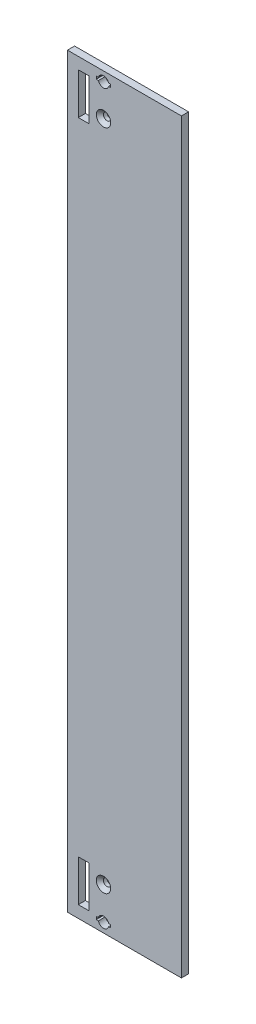
ISO-10303-21;
HEADER;
FILE_DESCRIPTION(('STEP AP214'),'2;1');
FILE_NAME('part.step','',(''),(''),'','','');
FILE_SCHEMA(('AUTOMOTIVE_DESIGN { 1 0 10303 214 1 1 1 1 }'));
ENDSEC;
DATA;
#1=APPLICATION_CONTEXT('core data for automotive mechanical design processes');
#2=APPLICATION_PROTOCOL_DEFINITION('international standard','automotive_design',2000,#1);
#3=PRODUCT_CONTEXT('',#1,'mechanical');
#4=PRODUCT('Part','Part','',(#3));
#5=PRODUCT_RELATED_PRODUCT_CATEGORY('part','',(#4));
#6=PRODUCT_DEFINITION_FORMATION('','',#4);
#7=PRODUCT_DEFINITION_CONTEXT('part definition',#1,'design');
#8=PRODUCT_DEFINITION('design','',#6,#7);
#9=PRODUCT_DEFINITION_SHAPE('','',#8);
#10=(LENGTH_UNIT() NAMED_UNIT(*) SI_UNIT(.MILLI.,.METRE.));
#11=(NAMED_UNIT(*) PLANE_ANGLE_UNIT() SI_UNIT($,.RADIAN.));
#12=(NAMED_UNIT(*) SI_UNIT($,.STERADIAN.) SOLID_ANGLE_UNIT());
#13=UNCERTAINTY_MEASURE_WITH_UNIT(LENGTH_MEASURE(1.E-05),#10,'distance_accuracy_value','');
#14=(GEOMETRIC_REPRESENTATION_CONTEXT(3) GLOBAL_UNCERTAINTY_ASSIGNED_CONTEXT((#13)) GLOBAL_UNIT_ASSIGNED_CONTEXT((#10,
#11,#12)) REPRESENTATION_CONTEXT('',''));
#15=CARTESIAN_POINT('',(0.,0.,0.));
#16=DIRECTION('',(0.,0.,1.));
#17=DIRECTION('',(1.,0.,0.));
#18=AXIS2_PLACEMENT_3D('',#15,#16,#17);
#19=CARTESIAN_POINT('',(0.,0.,2.5));
#20=DIRECTION('',(0.,0.,-1.));
#21=DIRECTION('',(-1.,0.,0.));
#22=AXIS2_PLACEMENT_3D('',#19,#20,#21);
#23=PLANE('',#22);
#24=CARTESIAN_POINT('',(12.65,14.75,2.5));
#25=DIRECTION('',(0.,0.,-1.));
#26=DIRECTION('',(-1.,0.,0.));
#27=AXIS2_PLACEMENT_3D('',#24,#25,#26);
#28=CIRCLE('',#27,2.53);
#29=CARTESIAN_POINT('',(10.12,14.75,2.5));
#30=VERTEX_POINT('',#29);
#31=EDGE_CURVE('E11',#30,#30,#28,.T.);
#32=ORIENTED_EDGE('',*,*,#31,.T.);
#33=EDGE_LOOP('',(#32));
#34=FACE_BOUND('',#33,.T.);
#35=CARTESIAN_POINT('',(12.65,247.5,2.5));
#36=DIRECTION('',(0.,0.,-1.));
#37=DIRECTION('',(-1.,0.,0.));
#38=AXIS2_PLACEMENT_3D('',#35,#36,#37);
#39=CIRCLE('',#38,2.53);
#40=CARTESIAN_POINT('',(10.12,247.5,2.5));
#41=VERTEX_POINT('',#40);
#42=EDGE_CURVE('E442',#41,#41,#39,.T.);
#43=ORIENTED_EDGE('',*,*,#42,.T.);
#44=EDGE_LOOP('',(#43));
#45=FACE_BOUND('',#44,.T.);
#46=CARTESIAN_POINT('',(12.65,3.3,2.5));
#47=DIRECTION('',(0.,0.,1.));
#48=DIRECTION('',(-1.,0.,0.));
#49=AXIS2_PLACEMENT_3D('',#46,#47,#48);
#50=CIRCLE('',#49,1.86);
#51=CARTESIAN_POINT('',(14.4415356541247,3.8,2.5));
#52=VERTEX_POINT('',#51);
#53=CARTESIAN_POINT('',(10.8584643458753,3.8,2.5));
#54=VERTEX_POINT('',#53);
#55=EDGE_CURVE('E283',#52,#54,#50,.T.);
#56=ORIENTED_EDGE('',*,*,#55,.F.);
#57=DIRECTION('',(-1.,0.,0.));
#58=VECTOR('',#57,1.);
#59=CARTESIAN_POINT('',(15.1915356541247,3.8,2.5));
#60=LINE('',#59,#58);
#61=CARTESIAN_POINT('',(15.1915356541247,3.8,2.5));
#62=VERTEX_POINT('',#61);
#63=EDGE_CURVE('E299',#62,#52,#60,.T.);
#64=ORIENTED_EDGE('',*,*,#63,.F.);
#65=DIRECTION('',(0.,1.,0.));
#66=VECTOR('',#65,1.);
#67=CARTESIAN_POINT('',(15.1915356541247,2.8,2.5));
#68=LINE('',#67,#66);
#69=CARTESIAN_POINT('',(15.1915356541247,2.8,2.5));
#70=VERTEX_POINT('',#69);
#71=EDGE_CURVE('E296',#70,#62,#68,.T.);
#72=ORIENTED_EDGE('',*,*,#71,.F.);
#73=DIRECTION('',(1.,0.,0.));
#74=VECTOR('',#73,1.);
#75=CARTESIAN_POINT('',(14.4415356541247,2.8,2.5));
#76=LINE('',#75,#74);
#77=CARTESIAN_POINT('',(14.4415356541247,2.8,2.5));
#78=VERTEX_POINT('',#77);
#79=EDGE_CURVE('E294',#78,#70,#76,.T.);
#80=ORIENTED_EDGE('',*,*,#79,.F.);
#81=CARTESIAN_POINT('',(12.65,3.3,2.5));
#82=DIRECTION('',(0.,0.,1.));
#83=DIRECTION('',(1.,0.,0.));
#84=AXIS2_PLACEMENT_3D('',#81,#82,#83);
#85=CIRCLE('',#84,1.86);
#86=CARTESIAN_POINT('',(10.8584643458753,2.8,2.5));
#87=VERTEX_POINT('',#86);
#88=EDGE_CURVE('E292',#87,#78,#85,.T.);
#89=ORIENTED_EDGE('',*,*,#88,.F.);
#90=DIRECTION('',(1.,0.,0.));
#91=VECTOR('',#90,1.);
#92=CARTESIAN_POINT('',(10.1084643458753,2.8,2.5));
#93=LINE('',#92,#91);
#94=CARTESIAN_POINT('',(10.1084643458753,2.8,2.5));
#95=VERTEX_POINT('',#94);
#96=EDGE_CURVE('E290',#95,#87,#93,.T.);
#97=ORIENTED_EDGE('',*,*,#96,.F.);
#98=DIRECTION('',(0.,-1.,0.));
#99=VECTOR('',#98,1.);
#100=CARTESIAN_POINT('',(10.1084643458753,3.8,2.5));
#101=LINE('',#100,#99);
#102=CARTESIAN_POINT('',(10.1084643458753,3.8,2.5));
#103=VERTEX_POINT('',#102);
#104=EDGE_CURVE('E288',#103,#95,#101,.T.);
#105=ORIENTED_EDGE('',*,*,#104,.F.);
#106=DIRECTION('',(-1.,0.,0.));
#107=VECTOR('',#106,1.);
#108=CARTESIAN_POINT('',(10.8584643458753,3.8,2.5));
#109=LINE('',#108,#107);
#110=EDGE_CURVE('E285',#54,#103,#109,.T.);
#111=ORIENTED_EDGE('',*,*,#110,.F.);
#112=EDGE_LOOP('',(#56,#64,#72,#80,#89,#97,#105,#111));
#113=FACE_BOUND('',#112,.T.);
#114=DIRECTION('',(0.,-1.,0.));
#115=VECTOR('',#114,1.);
#116=CARTESIAN_POINT('',(3.8,257.95,2.5));
#117=LINE('',#116,#115);
#118=CARTESIAN_POINT('',(3.8,257.95,2.5));
#119=VERTEX_POINT('',#118);
#120=CARTESIAN_POINT('',(3.8,243.4,2.5));
#121=VERTEX_POINT('',#120);
#122=EDGE_CURVE('E379',#119,#121,#117,.T.);
#123=ORIENTED_EDGE('',*,*,#122,.F.);
#124=DIRECTION('',(-1.,0.,0.));
#125=VECTOR('',#124,1.);
#126=CARTESIAN_POINT('',(3.8,257.95,2.5));
#127=LINE('',#126,#125);
#128=CARTESIAN_POINT('',(7.6,257.95,2.5));
#129=VERTEX_POINT('',#128);
#130=EDGE_CURVE('E387',#129,#119,#127,.T.);
#131=ORIENTED_EDGE('',*,*,#130,.F.);
#132=DIRECTION('',(0.,1.,0.));
#133=VECTOR('',#132,1.);
#134=CARTESIAN_POINT('',(7.6,257.95,2.5));
#135=LINE('',#134,#133);
#136=CARTESIAN_POINT('',(7.6,243.4,2.5));
#137=VERTEX_POINT('',#136);
#138=EDGE_CURVE('E384',#137,#129,#135,.T.);
#139=ORIENTED_EDGE('',*,*,#138,.F.);
#140=DIRECTION('',(1.,0.,0.));
#141=VECTOR('',#140,1.);
#142=CARTESIAN_POINT('',(3.8,243.4,2.5));
#143=LINE('',#142,#141);
#144=EDGE_CURVE('E381',#121,#137,#143,.T.);
#145=ORIENTED_EDGE('',*,*,#144,.F.);
#146=EDGE_LOOP('',(#123,#131,#139,#145));
#147=FACE_BOUND('',#146,.T.);
#148=DIRECTION('',(0.,-1.,0.));
#149=VECTOR('',#148,1.);
#150=CARTESIAN_POINT('',(0.,0.,2.5));
#151=LINE('',#150,#149);
#152=CARTESIAN_POINT('',(0.,262.,2.5));
#153=VERTEX_POINT('',#152);
#154=CARTESIAN_POINT('',(0.,0.,2.5));
#155=VERTEX_POINT('',#154);
#156=EDGE_CURVE('E410',#153,#155,#151,.T.);
#157=ORIENTED_EDGE('',*,*,#156,.T.);
#158=DIRECTION('',(1.,0.,0.));
#159=VECTOR('',#158,1.);
#160=CARTESIAN_POINT('',(0.,0.,2.5));
#161=LINE('',#160,#159);
#162=CARTESIAN_POINT('',(40.,0.,2.5));
#163=VERTEX_POINT('',#162);
#164=EDGE_CURVE('E413',#155,#163,#161,.T.);
#165=ORIENTED_EDGE('',*,*,#164,.T.);
#166=DIRECTION('',(0.,1.,0.));
#167=VECTOR('',#166,1.);
#168=CARTESIAN_POINT('',(40.,0.,2.5));
#169=LINE('',#168,#167);
#170=CARTESIAN_POINT('',(40.,262.,2.5));
#171=VERTEX_POINT('',#170);
#172=EDGE_CURVE('E416',#163,#171,#169,.T.);
#173=ORIENTED_EDGE('',*,*,#172,.T.);
#174=DIRECTION('',(-1.,0.,0.));
#175=VECTOR('',#174,1.);
#176=CARTESIAN_POINT('',(0.,262.,2.5));
#177=LINE('',#176,#175);
#178=EDGE_CURVE('E418',#171,#153,#177,.T.);
#179=ORIENTED_EDGE('',*,*,#178,.T.);
#180=EDGE_LOOP('',(#157,#165,#173,#179));
#181=FACE_BOUND('',#180,.T.);
#182=DIRECTION('',(0.,-1.,0.));
#183=VECTOR('',#182,1.);
#184=CARTESIAN_POINT('',(3.80000000000003,18.75,2.5));
#185=LINE('',#184,#183);
#186=CARTESIAN_POINT('',(3.80000000000003,18.75,2.5));
#187=VERTEX_POINT('',#186);
#188=CARTESIAN_POINT('',(3.80000000000003,4.19999999999999,2.5));
#189=VERTEX_POINT('',#188);
#190=EDGE_CURVE('E348',#187,#189,#185,.T.);
#191=ORIENTED_EDGE('',*,*,#190,.F.);
#192=DIRECTION('',(-1.,0.,0.));
#193=VECTOR('',#192,1.);
#194=CARTESIAN_POINT('',(3.80000000000003,18.75,2.5));
#195=LINE('',#194,#193);
#196=CARTESIAN_POINT('',(7.60000000000003,18.75,2.5));
#197=VERTEX_POINT('',#196);
#198=EDGE_CURVE('E356',#197,#187,#195,.T.);
#199=ORIENTED_EDGE('',*,*,#198,.F.);
#200=DIRECTION('',(0.,1.,0.));
#201=VECTOR('',#200,1.);
#202=CARTESIAN_POINT('',(7.60000000000003,18.75,2.5));
#203=LINE('',#202,#201);
#204=CARTESIAN_POINT('',(7.60000000000003,4.19999999999999,2.5));
#205=VERTEX_POINT('',#204);
#206=EDGE_CURVE('E353',#205,#197,#203,.T.);
#207=ORIENTED_EDGE('',*,*,#206,.F.);
#208=DIRECTION('',(1.,0.,0.));
#209=VECTOR('',#208,1.);
#210=CARTESIAN_POINT('',(3.80000000000003,4.19999999999999,2.5));
#211=LINE('',#210,#209);
#212=EDGE_CURVE('E350',#189,#205,#211,.T.);
#213=ORIENTED_EDGE('',*,*,#212,.F.);
#214=EDGE_LOOP('',(#191,#199,#207,#213));
#215=FACE_BOUND('',#214,.T.);
#216=CARTESIAN_POINT('',(12.65,258.7,2.5));
#217=DIRECTION('',(0.,0.,1.));
#218=DIRECTION('',(-1.,0.,0.));
#219=AXIS2_PLACEMENT_3D('',#216,#217,#218);
#220=CIRCLE('',#219,1.86);
#221=CARTESIAN_POINT('',(14.4415356541247,259.2,2.5));
#222=VERTEX_POINT('',#221);
#223=CARTESIAN_POINT('',(10.8584643458753,259.2,2.5));
#224=VERTEX_POINT('',#223);
#225=EDGE_CURVE('E218',#222,#224,#220,.T.);
#226=ORIENTED_EDGE('',*,*,#225,.F.);
#227=DIRECTION('',(-1.,0.,0.));
#228=VECTOR('',#227,1.);
#229=CARTESIAN_POINT('',(15.1915356541247,259.2,2.5));
#230=LINE('',#229,#228);
#231=CARTESIAN_POINT('',(15.1915356541247,259.2,2.5));
#232=VERTEX_POINT('',#231);
#233=EDGE_CURVE('E251',#232,#222,#230,.T.);
#234=ORIENTED_EDGE('',*,*,#233,.F.);
#235=DIRECTION('',(0.,1.,0.));
#236=VECTOR('',#235,1.);
#237=CARTESIAN_POINT('',(15.1915356541247,258.2,2.5));
#238=LINE('',#237,#236);
#239=CARTESIAN_POINT('',(15.1915356541247,258.2,2.5));
#240=VERTEX_POINT('',#239);
#241=EDGE_CURVE('E249',#240,#232,#238,.T.);
#242=ORIENTED_EDGE('',*,*,#241,.F.);
#243=DIRECTION('',(1.,0.,0.));
#244=VECTOR('',#243,1.);
#245=CARTESIAN_POINT('',(14.4415356541247,258.2,2.5));
#246=LINE('',#245,#244);
#247=CARTESIAN_POINT('',(14.4415356541247,258.2,2.5));
#248=VERTEX_POINT('',#247);
#249=EDGE_CURVE('E247',#248,#240,#246,.T.);
#250=ORIENTED_EDGE('',*,*,#249,.F.);
#251=CARTESIAN_POINT('',(12.65,258.7,2.5));
#252=DIRECTION('',(0.,0.,1.));
#253=DIRECTION('',(1.,0.,0.));
#254=AXIS2_PLACEMENT_3D('',#251,#252,#253);
#255=CIRCLE('',#254,1.86);
#256=CARTESIAN_POINT('',(10.8584643458753,258.2,2.5));
#257=VERTEX_POINT('',#256);
#258=EDGE_CURVE('E245',#257,#248,#255,.T.);
#259=ORIENTED_EDGE('',*,*,#258,.F.);
#260=DIRECTION('',(1.,0.,0.));
#261=VECTOR('',#260,1.);
#262=CARTESIAN_POINT('',(10.1084643458753,258.2,2.5));
#263=LINE('',#262,#261);
#264=CARTESIAN_POINT('',(10.1084643458753,258.2,2.5));
#265=VERTEX_POINT('',#264);
#266=EDGE_CURVE('E241',#265,#257,#263,.T.);
#267=ORIENTED_EDGE('',*,*,#266,.F.);
#268=DIRECTION('',(0.,-1.,0.));
#269=VECTOR('',#268,1.);
#270=CARTESIAN_POINT('',(10.1084643458753,259.2,2.5));
#271=LINE('',#270,#269);
#272=CARTESIAN_POINT('',(10.1084643458753,259.2,2.5));
#273=VERTEX_POINT('',#272);
#274=EDGE_CURVE('E239',#273,#265,#271,.T.);
#275=ORIENTED_EDGE('',*,*,#274,.F.);
#276=DIRECTION('',(-1.,0.,0.));
#277=VECTOR('',#276,1.);
#278=CARTESIAN_POINT('',(10.8584643458753,259.2,2.5));
#279=LINE('',#278,#277);
#280=EDGE_CURVE('E226',#224,#273,#279,.T.);
#281=ORIENTED_EDGE('',*,*,#280,.F.);
#282=EDGE_LOOP('',(#226,#234,#242,#250,#259,#267,#275,#281));
#283=FACE_BOUND('',#282,.T.);
#284=ADVANCED_FACE('F33',(#34,#45,#113,#147,#181,#215,#283),#23,.F.);
#285=CARTESIAN_POINT('',(0.,0.,0.));
#286=DIRECTION('',(0.,0.,-1.));
#287=DIRECTION('',(-1.,0.,0.));
#288=AXIS2_PLACEMENT_3D('',#285,#286,#287);
#289=PLANE('',#288);
#290=DIRECTION('',(-1.,0.,0.));
#291=VECTOR('',#290,1.);
#292=CARTESIAN_POINT('',(15.1915356541247,3.8,0.));
#293=LINE('',#292,#291);
#294=CARTESIAN_POINT('',(15.1915356541247,3.8,0.));
#295=VERTEX_POINT('',#294);
#296=CARTESIAN_POINT('',(14.4415356541247,3.8,0.));
#297=VERTEX_POINT('',#296);
#298=EDGE_CURVE('E286',#295,#297,#293,.T.);
#299=ORIENTED_EDGE('',*,*,#298,.T.);
#300=CARTESIAN_POINT('',(12.65,3.3,0.));
#301=DIRECTION('',(0.,0.,1.));
#302=DIRECTION('',(-1.,0.,0.));
#303=AXIS2_PLACEMENT_3D('',#300,#301,#302);
#304=CIRCLE('',#303,1.86);
#305=CARTESIAN_POINT('',(10.8584643458753,3.8,0.));
#306=VERTEX_POINT('',#305);
#307=EDGE_CURVE('E234',#297,#306,#304,.T.);
#308=ORIENTED_EDGE('',*,*,#307,.T.);
#309=DIRECTION('',(-1.,0.,0.));
#310=VECTOR('',#309,1.);
#311=CARTESIAN_POINT('',(10.8584643458753,3.8,0.));
#312=LINE('',#311,#310);
#313=CARTESIAN_POINT('',(10.1084643458753,3.8,0.));
#314=VERTEX_POINT('',#313);
#315=EDGE_CURVE('E304',#306,#314,#312,.T.);
#316=ORIENTED_EDGE('',*,*,#315,.T.);
#317=DIRECTION('',(0.,-1.,0.));
#318=VECTOR('',#317,1.);
#319=CARTESIAN_POINT('',(10.1084643458753,3.8,0.));
#320=LINE('',#319,#318);
#321=CARTESIAN_POINT('',(10.1084643458753,2.8,0.));
#322=VERTEX_POINT('',#321);
#323=EDGE_CURVE('E307',#314,#322,#320,.T.);
#324=ORIENTED_EDGE('',*,*,#323,.T.);
#325=DIRECTION('',(1.,0.,0.));
#326=VECTOR('',#325,1.);
#327=CARTESIAN_POINT('',(10.1084643458753,2.8,0.));
#328=LINE('',#327,#326);
#329=CARTESIAN_POINT('',(10.8584643458753,2.8,0.));
#330=VERTEX_POINT('',#329);
#331=EDGE_CURVE('E310',#322,#330,#328,.T.);
#332=ORIENTED_EDGE('',*,*,#331,.T.);
#333=CARTESIAN_POINT('',(12.65,3.3,0.));
#334=DIRECTION('',(0.,0.,1.));
#335=DIRECTION('',(1.,0.,0.));
#336=AXIS2_PLACEMENT_3D('',#333,#334,#335);
#337=CIRCLE('',#336,1.86);
#338=CARTESIAN_POINT('',(14.4415356541247,2.8,0.));
#339=VERTEX_POINT('',#338);
#340=EDGE_CURVE('E313',#330,#339,#337,.T.);
#341=ORIENTED_EDGE('',*,*,#340,.T.);
#342=DIRECTION('',(1.,0.,0.));
#343=VECTOR('',#342,1.);
#344=CARTESIAN_POINT('',(14.4415356541247,2.8,0.));
#345=LINE('',#344,#343);
#346=CARTESIAN_POINT('',(15.1915356541247,2.8,0.));
#347=VERTEX_POINT('',#346);
#348=EDGE_CURVE('E316',#339,#347,#345,.T.);
#349=ORIENTED_EDGE('',*,*,#348,.T.);
#350=DIRECTION('',(0.,1.,0.));
#351=VECTOR('',#350,1.);
#352=CARTESIAN_POINT('',(15.1915356541247,2.8,0.));
#353=LINE('',#352,#351);
#354=EDGE_CURVE('E319',#347,#295,#353,.T.);
#355=ORIENTED_EDGE('',*,*,#354,.T.);
#356=EDGE_LOOP('',(#299,#308,#316,#324,#332,#341,#349,#355));
#357=FACE_BOUND('',#356,.T.);
#358=CARTESIAN_POINT('',(12.65,247.5,0.));
#359=DIRECTION('',(0.,0.,1.));
#360=DIRECTION('',(1.,0.,0.));
#361=AXIS2_PLACEMENT_3D('',#358,#359,#360);
#362=CIRCLE('',#361,1.28);
#363=CARTESIAN_POINT('',(13.93,247.5,0.));
#364=VERTEX_POINT('',#363);
#365=EDGE_CURVE('E344',#364,#364,#362,.T.);
#366=ORIENTED_EDGE('',*,*,#365,.T.);
#367=EDGE_LOOP('',(#366));
#368=FACE_BOUND('',#367,.T.);
#369=DIRECTION('',(-1.,0.,0.));
#370=VECTOR('',#369,1.);
#371=CARTESIAN_POINT('',(3.8,257.95,0.));
#372=LINE('',#371,#370);
#373=CARTESIAN_POINT('',(7.6,257.95,0.));
#374=VERTEX_POINT('',#373);
#375=CARTESIAN_POINT('',(3.8,257.95,0.));
#376=VERTEX_POINT('',#375);
#377=EDGE_CURVE('E382',#374,#376,#372,.T.);
#378=ORIENTED_EDGE('',*,*,#377,.T.);
#379=DIRECTION('',(0.,-1.,0.));
#380=VECTOR('',#379,1.);
#381=CARTESIAN_POINT('',(3.8,257.95,0.));
#382=LINE('',#381,#380);
#383=CARTESIAN_POINT('',(3.8,243.4,0.));
#384=VERTEX_POINT('',#383);
#385=EDGE_CURVE('E378',#376,#384,#382,.T.);
#386=ORIENTED_EDGE('',*,*,#385,.T.);
#387=DIRECTION('',(1.,0.,0.));
#388=VECTOR('',#387,1.);
#389=CARTESIAN_POINT('',(3.8,243.4,0.));
#390=LINE('',#389,#388);
#391=CARTESIAN_POINT('',(7.6,243.4,0.));
#392=VERTEX_POINT('',#391);
#393=EDGE_CURVE('E392',#384,#392,#390,.T.);
#394=ORIENTED_EDGE('',*,*,#393,.T.);
#395=DIRECTION('',(0.,1.,0.));
#396=VECTOR('',#395,1.);
#397=CARTESIAN_POINT('',(7.6,257.95,0.));
#398=LINE('',#397,#396);
#399=EDGE_CURVE('E395',#392,#374,#398,.T.);
#400=ORIENTED_EDGE('',*,*,#399,.T.);
#401=EDGE_LOOP('',(#378,#386,#394,#400));
#402=FACE_BOUND('',#401,.T.);
#403=DIRECTION('',(0.,-1.,0.));
#404=VECTOR('',#403,1.);
#405=CARTESIAN_POINT('',(0.,0.,0.));
#406=LINE('',#405,#404);
#407=CARTESIAN_POINT('',(0.,262.,0.));
#408=VERTEX_POINT('',#407);
#409=CARTESIAN_POINT('',(0.,0.,0.));
#410=VERTEX_POINT('',#409);
#411=EDGE_CURVE('E409',#408,#410,#406,.T.);
#412=ORIENTED_EDGE('',*,*,#411,.F.);
#413=DIRECTION('',(-1.,0.,0.));
#414=VECTOR('',#413,1.);
#415=CARTESIAN_POINT('',(0.,262.,0.));
#416=LINE('',#415,#414);
#417=CARTESIAN_POINT('',(40.,262.,0.));
#418=VERTEX_POINT('',#417);
#419=EDGE_CURVE('E414',#418,#408,#416,.T.);
#420=ORIENTED_EDGE('',*,*,#419,.F.);
#421=DIRECTION('',(0.,1.,0.));
#422=VECTOR('',#421,1.);
#423=CARTESIAN_POINT('',(40.,0.,0.));
#424=LINE('',#423,#422);
#425=CARTESIAN_POINT('',(40.,0.,0.));
#426=VERTEX_POINT('',#425);
#427=EDGE_CURVE('E425',#426,#418,#424,.T.);
#428=ORIENTED_EDGE('',*,*,#427,.F.);
#429=DIRECTION('',(1.,0.,0.));
#430=VECTOR('',#429,1.);
#431=CARTESIAN_POINT('',(0.,0.,0.));
#432=LINE('',#431,#430);
#433=EDGE_CURVE('E423',#410,#426,#432,.T.);
#434=ORIENTED_EDGE('',*,*,#433,.F.);
#435=EDGE_LOOP('',(#412,#420,#428,#434));
#436=FACE_BOUND('',#435,.T.);
#437=DIRECTION('',(-1.,0.,0.));
#438=VECTOR('',#437,1.);
#439=CARTESIAN_POINT('',(3.80000000000003,18.75,0.));
#440=LINE('',#439,#438);
#441=CARTESIAN_POINT('',(7.60000000000003,18.75,0.));
#442=VERTEX_POINT('',#441);
#443=CARTESIAN_POINT('',(3.80000000000003,18.75,0.));
#444=VERTEX_POINT('',#443);
#445=EDGE_CURVE('E351',#442,#444,#440,.T.);
#446=ORIENTED_EDGE('',*,*,#445,.T.);
#447=DIRECTION('',(0.,-1.,0.));
#448=VECTOR('',#447,1.);
#449=CARTESIAN_POINT('',(3.80000000000003,18.75,0.));
#450=LINE('',#449,#448);
#451=CARTESIAN_POINT('',(3.80000000000003,4.19999999999999,0.));
#452=VERTEX_POINT('',#451);
#453=EDGE_CURVE('E347',#444,#452,#450,.T.);
#454=ORIENTED_EDGE('',*,*,#453,.T.);
#455=DIRECTION('',(1.,0.,0.));
#456=VECTOR('',#455,1.);
#457=CARTESIAN_POINT('',(3.80000000000003,4.19999999999999,0.));
#458=LINE('',#457,#456);
#459=CARTESIAN_POINT('',(7.60000000000003,4.19999999999999,0.));
#460=VERTEX_POINT('',#459);
#461=EDGE_CURVE('E361',#452,#460,#458,.T.);
#462=ORIENTED_EDGE('',*,*,#461,.T.);
#463=DIRECTION('',(0.,1.,0.));
#464=VECTOR('',#463,1.);
#465=CARTESIAN_POINT('',(7.60000000000003,18.75,0.));
#466=LINE('',#465,#464);
#467=EDGE_CURVE('E364',#460,#442,#466,.T.);
#468=ORIENTED_EDGE('',*,*,#467,.T.);
#469=EDGE_LOOP('',(#446,#454,#462,#468));
#470=FACE_BOUND('',#469,.T.);
#471=CARTESIAN_POINT('',(12.65,14.75,0.));
#472=DIRECTION('',(0.,0.,1.));
#473=DIRECTION('',(1.,0.,0.));
#474=AXIS2_PLACEMENT_3D('',#471,#472,#473);
#475=CIRCLE('',#474,1.28);
#476=CARTESIAN_POINT('',(13.93,14.75,0.));
#477=VERTEX_POINT('',#476);
#478=EDGE_CURVE('E341',#477,#477,#475,.T.);
#479=ORIENTED_EDGE('',*,*,#478,.T.);
#480=EDGE_LOOP('',(#479));
#481=FACE_BOUND('',#480,.T.);
#482=DIRECTION('',(-1.,0.,0.));
#483=VECTOR('',#482,1.);
#484=CARTESIAN_POINT('',(15.1915356541247,259.2,0.));
#485=LINE('',#484,#483);
#486=CARTESIAN_POINT('',(15.1915356541247,259.2,0.));
#487=VERTEX_POINT('',#486);
#488=CARTESIAN_POINT('',(14.4415356541247,259.2,0.));
#489=VERTEX_POINT('',#488);
#490=EDGE_CURVE('E227',#487,#489,#485,.T.);
#491=ORIENTED_EDGE('',*,*,#490,.T.);
#492=CARTESIAN_POINT('',(12.65,258.7,0.));
#493=DIRECTION('',(0.,0.,1.));
#494=DIRECTION('',(-1.,0.,0.));
#495=AXIS2_PLACEMENT_3D('',#492,#493,#494);
#496=CIRCLE('',#495,1.86);
#497=CARTESIAN_POINT('',(10.8584643458753,259.2,0.));
#498=VERTEX_POINT('',#497);
#499=EDGE_CURVE('E56',#489,#498,#496,.T.);
#500=ORIENTED_EDGE('',*,*,#499,.T.);
#501=DIRECTION('',(-1.,0.,0.));
#502=VECTOR('',#501,1.);
#503=CARTESIAN_POINT('',(10.8584643458753,259.2,0.));
#504=LINE('',#503,#502);
#505=CARTESIAN_POINT('',(10.1084643458753,259.2,0.));
#506=VERTEX_POINT('',#505);
#507=EDGE_CURVE('E233',#498,#506,#504,.T.);
#508=ORIENTED_EDGE('',*,*,#507,.T.);
#509=DIRECTION('',(0.,-1.,0.));
#510=VECTOR('',#509,1.);
#511=CARTESIAN_POINT('',(10.1084643458753,259.2,0.));
#512=LINE('',#511,#510);
#513=CARTESIAN_POINT('',(10.1084643458753,258.2,0.));
#514=VERTEX_POINT('',#513);
#515=EDGE_CURVE('E255',#506,#514,#512,.T.);
#516=ORIENTED_EDGE('',*,*,#515,.T.);
#517=DIRECTION('',(1.,0.,0.));
#518=VECTOR('',#517,1.);
#519=CARTESIAN_POINT('',(10.1084643458753,258.2,0.));
#520=LINE('',#519,#518);
#521=CARTESIAN_POINT('',(10.8584643458753,258.2,0.));
#522=VERTEX_POINT('',#521);
#523=EDGE_CURVE('E258',#514,#522,#520,.T.);
#524=ORIENTED_EDGE('',*,*,#523,.T.);
#525=CARTESIAN_POINT('',(12.65,258.7,0.));
#526=DIRECTION('',(0.,0.,1.));
#527=DIRECTION('',(1.,0.,0.));
#528=AXIS2_PLACEMENT_3D('',#525,#526,#527);
#529=CIRCLE('',#528,1.86);
#530=CARTESIAN_POINT('',(14.4415356541247,258.2,0.));
#531=VERTEX_POINT('',#530);
#532=EDGE_CURVE('E261',#522,#531,#529,.T.);
#533=ORIENTED_EDGE('',*,*,#532,.T.);
#534=DIRECTION('',(1.,0.,0.));
#535=VECTOR('',#534,1.);
#536=CARTESIAN_POINT('',(14.4415356541247,258.2,0.));
#537=LINE('',#536,#535);
#538=CARTESIAN_POINT('',(15.1915356541247,258.2,0.));
#539=VERTEX_POINT('',#538);
#540=EDGE_CURVE('E264',#531,#539,#537,.T.);
#541=ORIENTED_EDGE('',*,*,#540,.T.);
#542=DIRECTION('',(0.,1.,0.));
#543=VECTOR('',#542,1.);
#544=CARTESIAN_POINT('',(15.1915356541247,258.2,0.));
#545=LINE('',#544,#543);
#546=EDGE_CURVE('E267',#539,#487,#545,.T.);
#547=ORIENTED_EDGE('',*,*,#546,.T.);
#548=EDGE_LOOP('',(#491,#500,#508,#516,#524,#533,#541,#547));
#549=FACE_BOUND('',#548,.T.);
#550=ADVANCED_FACE('F460',(#357,#368,#402,#436,#470,#481,#549),#289,.T.);
#551=CARTESIAN_POINT('',(0.,0.,2.5));
#552=DIRECTION('',(1.,0.,0.));
#553=DIRECTION('',(0.,0.,-1.));
#554=AXIS2_PLACEMENT_3D('',#551,#552,#553);
#555=PLANE('',#554);
#556=ORIENTED_EDGE('',*,*,#411,.T.);
#557=DIRECTION('',(0.,0.,-1.));
#558=VECTOR('',#557,1.);
#559=CARTESIAN_POINT('',(0.,0.,2.5));
#560=LINE('',#559,#558);
#561=EDGE_CURVE('E436',#155,#410,#560,.T.);
#562=ORIENTED_EDGE('',*,*,#561,.F.);
#563=ORIENTED_EDGE('',*,*,#156,.F.);
#564=DIRECTION('',(0.,0.,-1.));
#565=VECTOR('',#564,1.);
#566=CARTESIAN_POINT('',(0.,262.,2.5));
#567=LINE('',#566,#565);
#568=EDGE_CURVE('E420',#153,#408,#567,.T.);
#569=ORIENTED_EDGE('',*,*,#568,.T.);
#570=EDGE_LOOP('',(#556,#562,#563,#569));
#571=FACE_BOUND('',#570,.T.);
#572=ADVANCED_FACE('F466',(#571),#555,.F.);
#573=CARTESIAN_POINT('',(0.,0.,2.5));
#574=DIRECTION('',(0.,1.,0.));
#575=DIRECTION('',(0.,0.,1.));
#576=AXIS2_PLACEMENT_3D('',#573,#574,#575);
#577=PLANE('',#576);
#578=ORIENTED_EDGE('',*,*,#433,.T.);
#579=DIRECTION('',(0.,0.,-1.));
#580=VECTOR('',#579,1.);
#581=CARTESIAN_POINT('',(40.,0.,2.5));
#582=LINE('',#581,#580);
#583=EDGE_CURVE('E433',#163,#426,#582,.T.);
#584=ORIENTED_EDGE('',*,*,#583,.F.);
#585=ORIENTED_EDGE('',*,*,#164,.F.);
#586=ORIENTED_EDGE('',*,*,#561,.T.);
#587=EDGE_LOOP('',(#578,#584,#585,#586));
#588=FACE_BOUND('',#587,.T.);
#589=ADVANCED_FACE('F481',(#588),#577,.F.);
#590=CARTESIAN_POINT('',(40.,0.,2.5));
#591=DIRECTION('',(-1.,0.,0.));
#592=DIRECTION('',(0.,0.,1.));
#593=AXIS2_PLACEMENT_3D('',#590,#591,#592);
#594=PLANE('',#593);
#595=ORIENTED_EDGE('',*,*,#427,.T.);
#596=DIRECTION('',(0.,0.,-1.));
#597=VECTOR('',#596,1.);
#598=CARTESIAN_POINT('',(40.,262.,2.5));
#599=LINE('',#598,#597);
#600=EDGE_CURVE('E430',#171,#418,#599,.T.);
#601=ORIENTED_EDGE('',*,*,#600,.F.);
#602=ORIENTED_EDGE('',*,*,#172,.F.);
#603=ORIENTED_EDGE('',*,*,#583,.T.);
#604=EDGE_LOOP('',(#595,#601,#602,#603));
#605=FACE_BOUND('',#604,.T.);
#606=ADVANCED_FACE('F477',(#605),#594,.F.);
#607=CARTESIAN_POINT('',(0.,262.,2.5));
#608=DIRECTION('',(0.,-1.,0.));
#609=DIRECTION('',(0.,0.,-1.));
#610=AXIS2_PLACEMENT_3D('',#607,#608,#609);
#611=PLANE('',#610);
#612=ORIENTED_EDGE('',*,*,#419,.T.);
#613=ORIENTED_EDGE('',*,*,#568,.F.);
#614=ORIENTED_EDGE('',*,*,#178,.F.);
#615=ORIENTED_EDGE('',*,*,#600,.T.);
#616=EDGE_LOOP('',(#612,#613,#614,#615));
#617=FACE_BOUND('',#616,.T.);
#618=ADVANCED_FACE('F474',(#617),#611,.F.);
#619=CARTESIAN_POINT('',(3.8,257.95,2.5));
#620=DIRECTION('',(1.,0.,0.));
#621=DIRECTION('',(0.,0.,-1.));
#622=AXIS2_PLACEMENT_3D('',#619,#620,#621);
#623=PLANE('',#622);
#624=ORIENTED_EDGE('',*,*,#385,.F.);
#625=DIRECTION('',(0.,0.,-1.));
#626=VECTOR('',#625,1.);
#627=CARTESIAN_POINT('',(3.8,257.95,2.5));
#628=LINE('',#627,#626);
#629=EDGE_CURVE('E389',#119,#376,#628,.T.);
#630=ORIENTED_EDGE('',*,*,#629,.F.);
#631=ORIENTED_EDGE('',*,*,#122,.T.);
#632=DIRECTION('',(0.,0.,-1.));
#633=VECTOR('',#632,1.);
#634=CARTESIAN_POINT('',(3.8,243.4,2.5));
#635=LINE('',#634,#633);
#636=EDGE_CURVE('E406',#121,#384,#635,.T.);
#637=ORIENTED_EDGE('',*,*,#636,.T.);
#638=EDGE_LOOP('',(#624,#630,#631,#637));
#639=FACE_BOUND('',#638,.T.);
#640=ADVANCED_FACE('F471',(#639),#623,.T.);
#641=CARTESIAN_POINT('',(3.8,243.4,2.5));
#642=DIRECTION('',(0.,1.,0.));
#643=DIRECTION('',(0.,0.,1.));
#644=AXIS2_PLACEMENT_3D('',#641,#642,#643);
#645=PLANE('',#644);
#646=ORIENTED_EDGE('',*,*,#393,.F.);
#647=ORIENTED_EDGE('',*,*,#636,.F.);
#648=ORIENTED_EDGE('',*,*,#144,.T.);
#649=DIRECTION('',(0.,0.,-1.));
#650=VECTOR('',#649,1.);
#651=CARTESIAN_POINT('',(7.6,243.4,2.5));
#652=LINE('',#651,#650);
#653=EDGE_CURVE('E404',#137,#392,#652,.T.);
#654=ORIENTED_EDGE('',*,*,#653,.T.);
#655=EDGE_LOOP('',(#646,#647,#648,#654));
#656=FACE_BOUND('',#655,.T.);
#657=ADVANCED_FACE('F541',(#656),#645,.T.);
#658=CARTESIAN_POINT('',(7.6,257.95,2.5));
#659=DIRECTION('',(-1.,0.,0.));
#660=DIRECTION('',(0.,0.,1.));
#661=AXIS2_PLACEMENT_3D('',#658,#659,#660);
#662=PLANE('',#661);
#663=ORIENTED_EDGE('',*,*,#399,.F.);
#664=ORIENTED_EDGE('',*,*,#653,.F.);
#665=ORIENTED_EDGE('',*,*,#138,.T.);
#666=DIRECTION('',(0.,0.,-1.));
#667=VECTOR('',#666,1.);
#668=CARTESIAN_POINT('',(7.6,257.95,2.5));
#669=LINE('',#668,#667);
#670=EDGE_CURVE('E402',#129,#374,#669,.T.);
#671=ORIENTED_EDGE('',*,*,#670,.T.);
#672=EDGE_LOOP('',(#663,#664,#665,#671));
#673=FACE_BOUND('',#672,.T.);
#674=ADVANCED_FACE('F538',(#673),#662,.T.);
#675=CARTESIAN_POINT('',(3.8,257.95,2.5));
#676=DIRECTION('',(0.,-1.,0.));
#677=DIRECTION('',(0.,0.,-1.));
#678=AXIS2_PLACEMENT_3D('',#675,#676,#677);
#679=PLANE('',#678);
#680=ORIENTED_EDGE('',*,*,#377,.F.);
#681=ORIENTED_EDGE('',*,*,#670,.F.);
#682=ORIENTED_EDGE('',*,*,#130,.T.);
#683=ORIENTED_EDGE('',*,*,#629,.T.);
#684=EDGE_LOOP('',(#680,#681,#682,#683));
#685=FACE_BOUND('',#684,.T.);
#686=ADVANCED_FACE('F535',(#685),#679,.T.);
#687=CARTESIAN_POINT('',(3.80000000000003,18.75,2.5));
#688=DIRECTION('',(1.,0.,0.));
#689=DIRECTION('',(0.,0.,-1.));
#690=AXIS2_PLACEMENT_3D('',#687,#688,#689);
#691=PLANE('',#690);
#692=ORIENTED_EDGE('',*,*,#453,.F.);
#693=DIRECTION('',(0.,0.,-1.));
#694=VECTOR('',#693,1.);
#695=CARTESIAN_POINT('',(3.80000000000003,18.75,2.5));
#696=LINE('',#695,#694);
#697=EDGE_CURVE('E358',#187,#444,#696,.T.);
#698=ORIENTED_EDGE('',*,*,#697,.F.);
#699=ORIENTED_EDGE('',*,*,#190,.T.);
#700=DIRECTION('',(0.,0.,-1.));
#701=VECTOR('',#700,1.);
#702=CARTESIAN_POINT('',(3.80000000000003,4.19999999999999,2.5));
#703=LINE('',#702,#701);
#704=EDGE_CURVE('E375',#189,#452,#703,.T.);
#705=ORIENTED_EDGE('',*,*,#704,.T.);
#706=EDGE_LOOP('',(#692,#698,#699,#705));
#707=FACE_BOUND('',#706,.T.);
#708=ADVANCED_FACE('F511',(#707),#691,.T.);
#709=CARTESIAN_POINT('',(3.80000000000003,4.19999999999999,2.5));
#710=DIRECTION('',(0.,1.,0.));
#711=DIRECTION('',(0.,0.,1.));
#712=AXIS2_PLACEMENT_3D('',#709,#710,#711);
#713=PLANE('',#712);
#714=ORIENTED_EDGE('',*,*,#461,.F.);
#715=ORIENTED_EDGE('',*,*,#704,.F.);
#716=ORIENTED_EDGE('',*,*,#212,.T.);
#717=DIRECTION('',(0.,0.,-1.));
#718=VECTOR('',#717,1.);
#719=CARTESIAN_POINT('',(7.60000000000003,4.19999999999999,2.5));
#720=LINE('',#719,#718);
#721=EDGE_CURVE('E373',#205,#460,#720,.T.);
#722=ORIENTED_EDGE('',*,*,#721,.T.);
#723=EDGE_LOOP('',(#714,#715,#716,#722));
#724=FACE_BOUND('',#723,.T.);
#725=ADVANCED_FACE('F513',(#724),#713,.T.);
#726=CARTESIAN_POINT('',(7.60000000000003,18.75,2.5));
#727=DIRECTION('',(-1.,0.,0.));
#728=DIRECTION('',(0.,0.,1.));
#729=AXIS2_PLACEMENT_3D('',#726,#727,#728);
#730=PLANE('',#729);
#731=ORIENTED_EDGE('',*,*,#467,.F.);
#732=ORIENTED_EDGE('',*,*,#721,.F.);
#733=ORIENTED_EDGE('',*,*,#206,.T.);
#734=DIRECTION('',(0.,0.,-1.));
#735=VECTOR('',#734,1.);
#736=CARTESIAN_POINT('',(7.60000000000003,18.75,2.5));
#737=LINE('',#736,#735);
#738=EDGE_CURVE('E371',#197,#442,#737,.T.);
#739=ORIENTED_EDGE('',*,*,#738,.T.);
#740=EDGE_LOOP('',(#731,#732,#733,#739));
#741=FACE_BOUND('',#740,.T.);
#742=ADVANCED_FACE('F521',(#741),#730,.T.);
#743=CARTESIAN_POINT('',(3.80000000000003,18.75,2.5));
#744=DIRECTION('',(0.,-1.,0.));
#745=DIRECTION('',(0.,0.,-1.));
#746=AXIS2_PLACEMENT_3D('',#743,#744,#745);
#747=PLANE('',#746);
#748=ORIENTED_EDGE('',*,*,#445,.F.);
#749=ORIENTED_EDGE('',*,*,#738,.F.);
#750=ORIENTED_EDGE('',*,*,#198,.T.);
#751=ORIENTED_EDGE('',*,*,#697,.T.);
#752=EDGE_LOOP('',(#748,#749,#750,#751));
#753=FACE_BOUND('',#752,.T.);
#754=ADVANCED_FACE('F519',(#753),#747,.T.);
#755=CARTESIAN_POINT('',(12.65,247.5,2.5));
#756=DIRECTION('',(0.,0.,-1.));
#757=DIRECTION('',(-1.,0.,0.));
#758=AXIS2_PLACEMENT_3D('',#755,#756,#757);
#759=CYLINDRICAL_SURFACE('',#758,1.28);
#760=CARTESIAN_POINT('',(12.65,247.5,1.24999999999999));
#761=DIRECTION('',(0.,0.,-1.));
#762=DIRECTION('',(-1.,0.,0.));
#763=AXIS2_PLACEMENT_3D('',#760,#761,#762);
#764=CIRCLE('',#763,1.28);
#765=CARTESIAN_POINT('',(11.37,247.5,1.24999999999999));
#766=VERTEX_POINT('',#765);
#767=EDGE_CURVE('E439',#766,#766,#764,.F.);
#768=ORIENTED_EDGE('',*,*,#767,.T.);
#769=EDGE_LOOP('',(#768));
#770=FACE_BOUND('',#769,.T.);
#771=ORIENTED_EDGE('',*,*,#365,.F.);
#772=EDGE_LOOP('',(#771));
#773=FACE_BOUND('',#772,.T.);
#774=ADVANCED_FACE('F528',(#770,#773),#759,.F.);
#775=CARTESIAN_POINT('',(12.65,14.75,2.5));
#776=DIRECTION('',(0.,0.,-1.));
#777=DIRECTION('',(-1.,0.,0.));
#778=AXIS2_PLACEMENT_3D('',#775,#776,#777);
#779=CYLINDRICAL_SURFACE('',#778,1.28);
#780=CARTESIAN_POINT('',(12.65,14.75,1.24999999999999));
#781=DIRECTION('',(0.,0.,-1.));
#782=DIRECTION('',(-1.,0.,0.));
#783=AXIS2_PLACEMENT_3D('',#780,#781,#782);
#784=CIRCLE('',#783,1.28);
#785=CARTESIAN_POINT('',(11.37,14.75,1.24999999999999));
#786=VERTEX_POINT('',#785);
#787=EDGE_CURVE('E41',#786,#786,#784,.F.);
#788=ORIENTED_EDGE('',*,*,#787,.T.);
#789=EDGE_LOOP('',(#788));
#790=FACE_BOUND('',#789,.T.);
#791=ORIENTED_EDGE('',*,*,#478,.F.);
#792=EDGE_LOOP('',(#791));
#793=FACE_BOUND('',#792,.T.);
#794=ADVANCED_FACE('F447',(#790,#793),#779,.F.);
#795=CARTESIAN_POINT('',(12.65,3.3,2.5));
#796=DIRECTION('',(0.,0.,-1.));
#797=DIRECTION('',(-1.,0.,0.));
#798=AXIS2_PLACEMENT_3D('',#795,#796,#797);
#799=CYLINDRICAL_SURFACE('',#798,1.86);
#800=ORIENTED_EDGE('',*,*,#307,.F.);
#801=DIRECTION('',(0.,0.,-1.));
#802=VECTOR('',#801,1.);
#803=CARTESIAN_POINT('',(14.4415356541247,3.8,2.5));
#804=LINE('',#803,#802);
#805=EDGE_CURVE('E301',#52,#297,#804,.T.);
#806=ORIENTED_EDGE('',*,*,#805,.F.);
#807=ORIENTED_EDGE('',*,*,#55,.T.);
#808=DIRECTION('',(0.,0.,-1.));
#809=VECTOR('',#808,1.);
#810=CARTESIAN_POINT('',(10.8584643458753,3.8,2.5));
#811=LINE('',#810,#809);
#812=EDGE_CURVE('E338',#54,#306,#811,.T.);
#813=ORIENTED_EDGE('',*,*,#812,.T.);
#814=EDGE_LOOP('',(#800,#806,#807,#813));
#815=FACE_BOUND('',#814,.T.);
#816=ADVANCED_FACE('F600',(#815),#799,.F.);
#817=CARTESIAN_POINT('',(10.8584643458753,3.8,2.5));
#818=DIRECTION('',(0.,-1.,0.));
#819=DIRECTION('',(0.,0.,-1.));
#820=AXIS2_PLACEMENT_3D('',#817,#818,#819);
#821=PLANE('',#820);
#822=ORIENTED_EDGE('',*,*,#315,.F.);
#823=ORIENTED_EDGE('',*,*,#812,.F.);
#824=ORIENTED_EDGE('',*,*,#110,.T.);
#825=DIRECTION('',(0.,0.,-1.));
#826=VECTOR('',#825,1.);
#827=CARTESIAN_POINT('',(10.1084643458753,3.8,2.5));
#828=LINE('',#827,#826);
#829=EDGE_CURVE('E336',#103,#314,#828,.T.);
#830=ORIENTED_EDGE('',*,*,#829,.T.);
#831=EDGE_LOOP('',(#822,#823,#824,#830));
#832=FACE_BOUND('',#831,.T.);
#833=ADVANCED_FACE('F733',(#832),#821,.T.);
#834=CARTESIAN_POINT('',(10.1084643458753,3.8,2.5));
#835=DIRECTION('',(1.,0.,0.));
#836=DIRECTION('',(0.,0.,-1.));
#837=AXIS2_PLACEMENT_3D('',#834,#835,#836);
#838=PLANE('',#837);
#839=ORIENTED_EDGE('',*,*,#323,.F.);
#840=ORIENTED_EDGE('',*,*,#829,.F.);
#841=ORIENTED_EDGE('',*,*,#104,.T.);
#842=DIRECTION('',(0.,0.,-1.));
#843=VECTOR('',#842,1.);
#844=CARTESIAN_POINT('',(10.1084643458753,2.8,2.5));
#845=LINE('',#844,#843);
#846=EDGE_CURVE('E334',#95,#322,#845,.T.);
#847=ORIENTED_EDGE('',*,*,#846,.T.);
#848=EDGE_LOOP('',(#839,#840,#841,#847));
#849=FACE_BOUND('',#848,.T.);
#850=ADVANCED_FACE('F724',(#849),#838,.T.);
#851=CARTESIAN_POINT('',(10.1084643458753,2.8,2.5));
#852=DIRECTION('',(0.,1.,0.));
#853=DIRECTION('',(0.,0.,1.));
#854=AXIS2_PLACEMENT_3D('',#851,#852,#853);
#855=PLANE('',#854);
#856=ORIENTED_EDGE('',*,*,#331,.F.);
#857=ORIENTED_EDGE('',*,*,#846,.F.);
#858=ORIENTED_EDGE('',*,*,#96,.T.);
#859=DIRECTION('',(0.,0.,-1.));
#860=VECTOR('',#859,1.);
#861=CARTESIAN_POINT('',(10.8584643458753,2.8,2.5));
#862=LINE('',#861,#860);
#863=EDGE_CURVE('E332',#87,#330,#862,.T.);
#864=ORIENTED_EDGE('',*,*,#863,.T.);
#865=EDGE_LOOP('',(#856,#857,#858,#864));
#866=FACE_BOUND('',#865,.T.);
#867=ADVANCED_FACE('F715',(#866),#855,.T.);
#868=CARTESIAN_POINT('',(12.65,3.3,2.5));
#869=DIRECTION('',(0.,0.,-1.));
#870=DIRECTION('',(-1.,0.,0.));
#871=AXIS2_PLACEMENT_3D('',#868,#869,#870);
#872=CYLINDRICAL_SURFACE('',#871,1.86);
#873=ORIENTED_EDGE('',*,*,#340,.F.);
#874=ORIENTED_EDGE('',*,*,#863,.F.);
#875=ORIENTED_EDGE('',*,*,#88,.T.);
#876=DIRECTION('',(0.,0.,-1.));
#877=VECTOR('',#876,1.);
#878=CARTESIAN_POINT('',(14.4415356541247,2.8,2.5));
#879=LINE('',#878,#877);
#880=EDGE_CURVE('E330',#78,#339,#879,.T.);
#881=ORIENTED_EDGE('',*,*,#880,.T.);
#882=EDGE_LOOP('',(#873,#874,#875,#881));
#883=FACE_BOUND('',#882,.T.);
#884=ADVANCED_FACE('F706',(#883),#872,.F.);
#885=CARTESIAN_POINT('',(14.4415356541247,2.8,2.5));
#886=DIRECTION('',(0.,1.,0.));
#887=DIRECTION('',(0.,0.,1.));
#888=AXIS2_PLACEMENT_3D('',#885,#886,#887);
#889=PLANE('',#888);
#890=ORIENTED_EDGE('',*,*,#348,.F.);
#891=ORIENTED_EDGE('',*,*,#880,.F.);
#892=ORIENTED_EDGE('',*,*,#79,.T.);
#893=DIRECTION('',(0.,0.,-1.));
#894=VECTOR('',#893,1.);
#895=CARTESIAN_POINT('',(15.1915356541247,2.8,2.5));
#896=LINE('',#895,#894);
#897=EDGE_CURVE('E328',#70,#347,#896,.T.);
#898=ORIENTED_EDGE('',*,*,#897,.T.);
#899=EDGE_LOOP('',(#890,#891,#892,#898));
#900=FACE_BOUND('',#899,.T.);
#901=ADVANCED_FACE('F697',(#900),#889,.T.);
#902=CARTESIAN_POINT('',(15.1915356541247,2.8,2.5));
#903=DIRECTION('',(-1.,0.,0.));
#904=DIRECTION('',(0.,0.,1.));
#905=AXIS2_PLACEMENT_3D('',#902,#903,#904);
#906=PLANE('',#905);
#907=ORIENTED_EDGE('',*,*,#354,.F.);
#908=ORIENTED_EDGE('',*,*,#897,.F.);
#909=ORIENTED_EDGE('',*,*,#71,.T.);
#910=DIRECTION('',(0.,0.,-1.));
#911=VECTOR('',#910,1.);
#912=CARTESIAN_POINT('',(15.1915356541247,3.8,2.5));
#913=LINE('',#912,#911);
#914=EDGE_CURVE('E326',#62,#295,#913,.T.);
#915=ORIENTED_EDGE('',*,*,#914,.T.);
#916=EDGE_LOOP('',(#907,#908,#909,#915));
#917=FACE_BOUND('',#916,.T.);
#918=ADVANCED_FACE('F688',(#917),#906,.T.);
#919=CARTESIAN_POINT('',(15.1915356541247,3.8,2.5));
#920=DIRECTION('',(0.,-1.,0.));
#921=DIRECTION('',(1.,0.,0.));
#922=AXIS2_PLACEMENT_3D('',#919,#920,#921);
#923=PLANE('',#922);
#924=ORIENTED_EDGE('',*,*,#298,.F.);
#925=ORIENTED_EDGE('',*,*,#914,.F.);
#926=ORIENTED_EDGE('',*,*,#63,.T.);
#927=ORIENTED_EDGE('',*,*,#805,.T.);
#928=EDGE_LOOP('',(#924,#925,#926,#927));
#929=FACE_BOUND('',#928,.T.);
#930=ADVANCED_FACE('F680',(#929),#923,.T.);
#931=CARTESIAN_POINT('',(12.65,258.7,2.5));
#932=DIRECTION('',(0.,0.,-1.));
#933=DIRECTION('',(-1.,0.,0.));
#934=AXIS2_PLACEMENT_3D('',#931,#932,#933);
#935=CYLINDRICAL_SURFACE('',#934,1.86);
#936=ORIENTED_EDGE('',*,*,#499,.F.);
#937=DIRECTION('',(0.,0.,-1.));
#938=VECTOR('',#937,1.);
#939=CARTESIAN_POINT('',(14.4415356541247,259.2,2.5));
#940=LINE('',#939,#938);
#941=EDGE_CURVE('E222',#222,#489,#940,.T.);
#942=ORIENTED_EDGE('',*,*,#941,.F.);
#943=ORIENTED_EDGE('',*,*,#225,.T.);
#944=DIRECTION('',(0.,0.,-1.));
#945=VECTOR('',#944,1.);
#946=CARTESIAN_POINT('',(10.8584643458753,259.2,2.5));
#947=LINE('',#946,#945);
#948=EDGE_CURVE('E221',#224,#498,#947,.T.);
#949=ORIENTED_EDGE('',*,*,#948,.T.);
#950=EDGE_LOOP('',(#936,#942,#943,#949));
#951=FACE_BOUND('',#950,.T.);
#952=ADVANCED_FACE('F220',(#951),#935,.F.);
#953=CARTESIAN_POINT('',(10.8584643458753,259.2,2.5));
#954=DIRECTION('',(0.,-1.,0.));
#955=DIRECTION('',(0.,0.,-1.));
#956=AXIS2_PLACEMENT_3D('',#953,#954,#955);
#957=PLANE('',#956);
#958=ORIENTED_EDGE('',*,*,#507,.F.);
#959=ORIENTED_EDGE('',*,*,#948,.F.);
#960=ORIENTED_EDGE('',*,*,#280,.T.);
#961=DIRECTION('',(0.,0.,-1.));
#962=VECTOR('',#961,1.);
#963=CARTESIAN_POINT('',(10.1084643458753,259.2,2.5));
#964=LINE('',#963,#962);
#965=EDGE_CURVE('E235',#273,#506,#964,.T.);
#966=ORIENTED_EDGE('',*,*,#965,.T.);
#967=EDGE_LOOP('',(#958,#959,#960,#966));
#968=FACE_BOUND('',#967,.T.);
#969=ADVANCED_FACE('F230',(#968),#957,.T.);
#970=CARTESIAN_POINT('',(10.1084643458753,259.2,2.5));
#971=DIRECTION('',(1.,0.,0.));
#972=DIRECTION('',(0.,0.,-1.));
#973=AXIS2_PLACEMENT_3D('',#970,#971,#972);
#974=PLANE('',#973);
#975=ORIENTED_EDGE('',*,*,#515,.F.);
#976=ORIENTED_EDGE('',*,*,#965,.F.);
#977=ORIENTED_EDGE('',*,*,#274,.T.);
#978=DIRECTION('',(0.,0.,-1.));
#979=VECTOR('',#978,1.);
#980=CARTESIAN_POINT('',(10.1084643458753,258.2,2.5));
#981=LINE('',#980,#979);
#982=EDGE_CURVE('E280',#265,#514,#981,.T.);
#983=ORIENTED_EDGE('',*,*,#982,.T.);
#984=EDGE_LOOP('',(#975,#976,#977,#983));
#985=FACE_BOUND('',#984,.T.);
#986=ADVANCED_FACE('F656',(#985),#974,.T.);
#987=CARTESIAN_POINT('',(10.1084643458753,258.2,2.5));
#988=DIRECTION('',(0.,1.,0.));
#989=DIRECTION('',(0.,0.,1.));
#990=AXIS2_PLACEMENT_3D('',#987,#988,#989);
#991=PLANE('',#990);
#992=ORIENTED_EDGE('',*,*,#523,.F.);
#993=ORIENTED_EDGE('',*,*,#982,.F.);
#994=ORIENTED_EDGE('',*,*,#266,.T.);
#995=DIRECTION('',(0.,0.,-1.));
#996=VECTOR('',#995,1.);
#997=CARTESIAN_POINT('',(10.8584643458753,258.2,2.5));
#998=LINE('',#997,#996);
#999=EDGE_CURVE('E278',#257,#522,#998,.T.);
#1000=ORIENTED_EDGE('',*,*,#999,.T.);
#1001=EDGE_LOOP('',(#992,#993,#994,#1000));
#1002=FACE_BOUND('',#1001,.T.);
#1003=ADVANCED_FACE('F647',(#1002),#991,.T.);
#1004=CARTESIAN_POINT('',(12.65,258.7,2.5));
#1005=DIRECTION('',(0.,0.,-1.));
#1006=DIRECTION('',(-1.,0.,0.));
#1007=AXIS2_PLACEMENT_3D('',#1004,#1005,#1006);
#1008=CYLINDRICAL_SURFACE('',#1007,1.86);
#1009=ORIENTED_EDGE('',*,*,#532,.F.);
#1010=ORIENTED_EDGE('',*,*,#999,.F.);
#1011=ORIENTED_EDGE('',*,*,#258,.T.);
#1012=DIRECTION('',(0.,0.,-1.));
#1013=VECTOR('',#1012,1.);
#1014=CARTESIAN_POINT('',(14.4415356541247,258.2,2.5));
#1015=LINE('',#1014,#1013);
#1016=EDGE_CURVE('E276',#248,#531,#1015,.T.);
#1017=ORIENTED_EDGE('',*,*,#1016,.T.);
#1018=EDGE_LOOP('',(#1009,#1010,#1011,#1017));
#1019=FACE_BOUND('',#1018,.T.);
#1020=ADVANCED_FACE('F638',(#1019),#1008,.F.);
#1021=CARTESIAN_POINT('',(14.4415356541247,258.2,2.5));
#1022=DIRECTION('',(0.,1.,0.));
#1023=DIRECTION('',(0.,0.,1.));
#1024=AXIS2_PLACEMENT_3D('',#1021,#1022,#1023);
#1025=PLANE('',#1024);
#1026=ORIENTED_EDGE('',*,*,#540,.F.);
#1027=ORIENTED_EDGE('',*,*,#1016,.F.);
#1028=ORIENTED_EDGE('',*,*,#249,.T.);
#1029=DIRECTION('',(0.,0.,-1.));
#1030=VECTOR('',#1029,1.);
#1031=CARTESIAN_POINT('',(15.1915356541247,258.2,2.5));
#1032=LINE('',#1031,#1030);
#1033=EDGE_CURVE('E274',#240,#539,#1032,.T.);
#1034=ORIENTED_EDGE('',*,*,#1033,.T.);
#1035=EDGE_LOOP('',(#1026,#1027,#1028,#1034));
#1036=FACE_BOUND('',#1035,.T.);
#1037=ADVANCED_FACE('F629',(#1036),#1025,.T.);
#1038=CARTESIAN_POINT('',(15.1915356541247,258.2,2.5));
#1039=DIRECTION('',(-1.,0.,0.));
#1040=DIRECTION('',(0.,0.,1.));
#1041=AXIS2_PLACEMENT_3D('',#1038,#1039,#1040);
#1042=PLANE('',#1041);
#1043=ORIENTED_EDGE('',*,*,#546,.F.);
#1044=ORIENTED_EDGE('',*,*,#1033,.F.);
#1045=ORIENTED_EDGE('',*,*,#241,.T.);
#1046=DIRECTION('',(0.,0.,-1.));
#1047=VECTOR('',#1046,1.);
#1048=CARTESIAN_POINT('',(15.1915356541247,259.2,2.5));
#1049=LINE('',#1048,#1047);
#1050=EDGE_CURVE('E48',#232,#487,#1049,.T.);
#1051=ORIENTED_EDGE('',*,*,#1050,.T.);
#1052=EDGE_LOOP('',(#1043,#1044,#1045,#1051));
#1053=FACE_BOUND('',#1052,.T.);
#1054=ADVANCED_FACE('F621',(#1053),#1042,.T.);
#1055=CARTESIAN_POINT('',(15.1915356541247,259.2,2.5));
#1056=DIRECTION('',(0.,-1.,0.));
#1057=DIRECTION('',(0.,0.,-1.));
#1058=AXIS2_PLACEMENT_3D('',#1055,#1056,#1057);
#1059=PLANE('',#1058);
#1060=ORIENTED_EDGE('',*,*,#490,.F.);
#1061=ORIENTED_EDGE('',*,*,#1050,.F.);
#1062=ORIENTED_EDGE('',*,*,#233,.T.);
#1063=ORIENTED_EDGE('',*,*,#941,.T.);
#1064=EDGE_LOOP('',(#1060,#1061,#1062,#1063));
#1065=FACE_BOUND('',#1064,.T.);
#1066=ADVANCED_FACE('F456',(#1065),#1059,.T.);
#1067=CARTESIAN_POINT('',(12.65,247.5,1.24999999999999));
#1068=DIRECTION('',(0.,0.,1.));
#1069=DIRECTION('',(1.,0.,0.));
#1070=AXIS2_PLACEMENT_3D('',#1067,#1068,#1069);
#1071=CONICAL_SURFACE('',#1070,1.28,0.785398163397447);
#1072=ORIENTED_EDGE('',*,*,#42,.F.);
#1073=EDGE_LOOP('',(#1072));
#1074=FACE_BOUND('',#1073,.T.);
#1075=ORIENTED_EDGE('',*,*,#767,.F.);
#1076=EDGE_LOOP('',(#1075));
#1077=FACE_BOUND('',#1076,.T.);
#1078=ADVANCED_FACE('F451',(#1074,#1077),#1071,.F.);
#1079=CARTESIAN_POINT('',(12.65,14.75,1.24999999999999));
#1080=DIRECTION('',(0.,0.,1.));
#1081=DIRECTION('',(1.,0.,0.));
#1082=AXIS2_PLACEMENT_3D('',#1079,#1080,#1081);
#1083=CONICAL_SURFACE('',#1082,1.28,0.785398163397447);
#1084=ORIENTED_EDGE('',*,*,#31,.F.);
#1085=EDGE_LOOP('',(#1084));
#1086=FACE_BOUND('',#1085,.T.);
#1087=ORIENTED_EDGE('',*,*,#787,.F.);
#1088=EDGE_LOOP('',(#1087));
#1089=FACE_BOUND('',#1088,.T.);
#1090=ADVANCED_FACE('F35',(#1086,#1089),#1083,.F.);
#1091=CLOSED_SHELL('',(#284,#550,#572,#589,#606,#618,#640,#657,#674,#686,#708,#725,#742,#754,
#774,#794,#816,#833,#850,#867,#884,#901,#918,#930,#952,#969,#986,#1003,#1020,#1037,#1054,#1066,
#1078,#1090));
#1092=MANIFOLD_SOLID_BREP('B2',#1091);
#1093=ADVANCED_BREP_SHAPE_REPRESENTATION('',(#18,#1092),#14);
#1094=SHAPE_DEFINITION_REPRESENTATION(#9,#1093);
ENDSEC;
END-ISO-10303-21;
